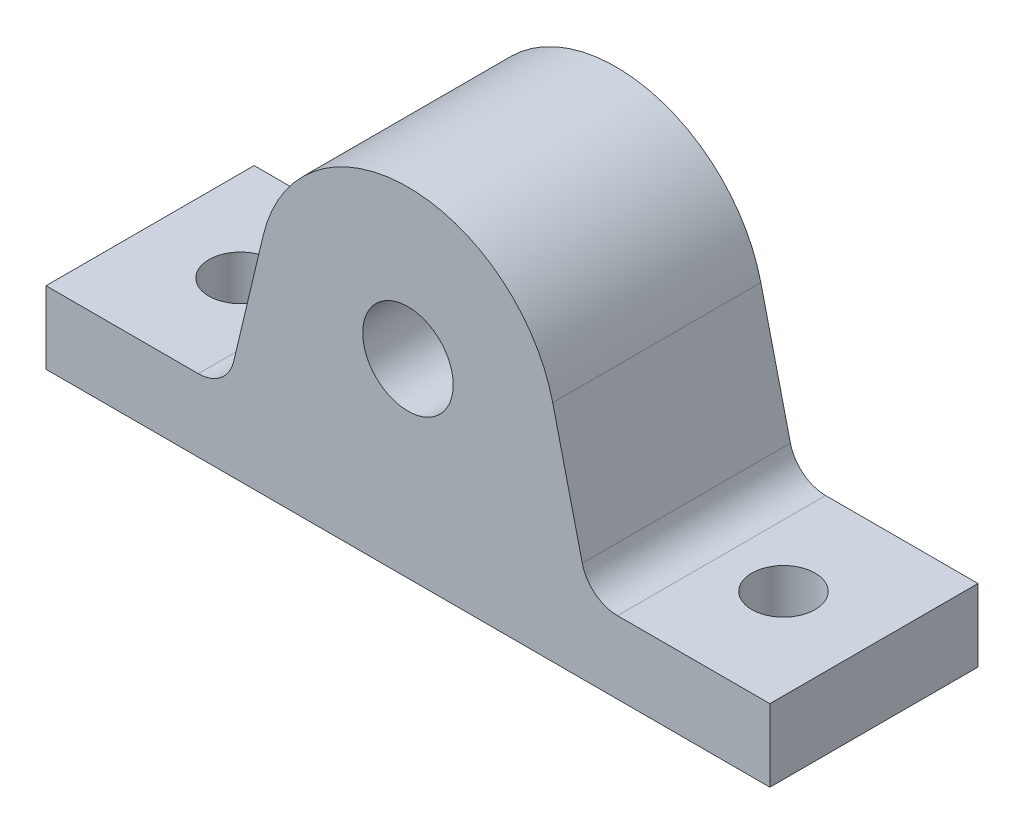
ISO-10303-21;
HEADER;
FILE_DESCRIPTION(('STEP AP214'),'2;1');
FILE_NAME('part.step','',(''),(''),'','','');
FILE_SCHEMA(('AUTOMOTIVE_DESIGN { 1 0 10303 214 1 1 1 1 }'));
ENDSEC;
DATA;
#1=APPLICATION_CONTEXT('core data for automotive mechanical design processes');
#2=APPLICATION_PROTOCOL_DEFINITION('international standard','automotive_design',2000,#1);
#3=PRODUCT_CONTEXT('',#1,'mechanical');
#4=PRODUCT('Part','Part','',(#3));
#5=PRODUCT_RELATED_PRODUCT_CATEGORY('part','',(#4));
#6=PRODUCT_DEFINITION_FORMATION('','',#4);
#7=PRODUCT_DEFINITION_CONTEXT('part definition',#1,'design');
#8=PRODUCT_DEFINITION('design','',#6,#7);
#9=PRODUCT_DEFINITION_SHAPE('','',#8);
#10=(LENGTH_UNIT() NAMED_UNIT(*) SI_UNIT(.MILLI.,.METRE.));
#11=(NAMED_UNIT(*) PLANE_ANGLE_UNIT() SI_UNIT($,.RADIAN.));
#12=(NAMED_UNIT(*) SI_UNIT($,.STERADIAN.) SOLID_ANGLE_UNIT());
#13=UNCERTAINTY_MEASURE_WITH_UNIT(LENGTH_MEASURE(1.E-05),#10,'distance_accuracy_value','');
#14=(GEOMETRIC_REPRESENTATION_CONTEXT(3) GLOBAL_UNCERTAINTY_ASSIGNED_CONTEXT((#13)) GLOBAL_UNIT_ASSIGNED_CONTEXT((#10,
#11,#12)) REPRESENTATION_CONTEXT('',''));
#15=CARTESIAN_POINT('',(0.,0.,0.));
#16=DIRECTION('',(0.,0.,1.));
#17=DIRECTION('',(1.,0.,0.));
#18=AXIS2_PLACEMENT_3D('',#15,#16,#17);
#19=CARTESIAN_POINT('',(-63.5,0.,18.25625));
#20=DIRECTION('',(1.,0.,0.));
#21=DIRECTION('',(0.,0.,-1.));
#22=AXIS2_PLACEMENT_3D('',#19,#20,#21);
#23=PLANE('',#22);
#24=DIRECTION('',(0.,-1.,0.));
#25=VECTOR('',#24,1.);
#26=CARTESIAN_POINT('',(-63.5,0.,-18.25625));
#27=LINE('',#26,#25);
#28=CARTESIAN_POINT('',(-63.5,12.7,-18.25625));
#29=VERTEX_POINT('',#28);
#30=CARTESIAN_POINT('',(-63.5,0.,-18.25625));
#31=VERTEX_POINT('',#30);
#32=EDGE_CURVE('E131',#29,#31,#27,.T.);
#33=ORIENTED_EDGE('',*,*,#32,.T.);
#34=DIRECTION('',(0.,0.,-1.));
#35=VECTOR('',#34,1.);
#36=CARTESIAN_POINT('',(-63.5,0.,18.25625));
#37=LINE('',#36,#35);
#38=CARTESIAN_POINT('',(-63.5,0.,18.25625));
#39=VERTEX_POINT('',#38);
#40=EDGE_CURVE('E112',#39,#31,#37,.T.);
#41=ORIENTED_EDGE('',*,*,#40,.F.);
#42=DIRECTION('',(0.,-1.,0.));
#43=VECTOR('',#42,1.);
#44=CARTESIAN_POINT('',(-63.5,0.,18.25625));
#45=LINE('',#44,#43);
#46=CARTESIAN_POINT('',(-63.5,12.7,18.25625));
#47=VERTEX_POINT('',#46);
#48=EDGE_CURVE('E119',#47,#39,#45,.T.);
#49=ORIENTED_EDGE('',*,*,#48,.F.);
#50=DIRECTION('',(0.,0.,-1.));
#51=VECTOR('',#50,1.);
#52=CARTESIAN_POINT('',(-63.5,12.7,18.25625));
#53=LINE('',#52,#51);
#54=EDGE_CURVE('E159',#47,#29,#53,.T.);
#55=ORIENTED_EDGE('',*,*,#54,.T.);
#56=EDGE_LOOP('',(#33,#41,#49,#55));
#57=FACE_BOUND('',#56,.T.);
#58=ADVANCED_FACE('F31',(#57),#23,.F.);
#59=CARTESIAN_POINT('',(-63.5,0.,18.25625));
#60=DIRECTION('',(0.,1.,0.));
#61=DIRECTION('',(0.,0.,1.));
#62=AXIS2_PLACEMENT_3D('',#59,#60,#61);
#63=PLANE('',#62);
#64=CARTESIAN_POINT('',(-47.625,0.,0.));
#65=DIRECTION('',(0.,1.,0.));
#66=DIRECTION('',(0.,0.,1.));
#67=AXIS2_PLACEMENT_3D('',#64,#65,#66);
#68=CIRCLE('',#67,5.55625);
#69=CARTESIAN_POINT('',(-47.625,0.,5.55625));
#70=VERTEX_POINT('',#69);
#71=EDGE_CURVE('E214',#70,#70,#68,.T.);
#72=ORIENTED_EDGE('',*,*,#71,.T.);
#73=EDGE_LOOP('',(#72));
#74=FACE_BOUND('',#73,.T.);
#75=CARTESIAN_POINT('',(47.625,0.,0.));
#76=DIRECTION('',(0.,1.,0.));
#77=DIRECTION('',(0.,0.,1.));
#78=AXIS2_PLACEMENT_3D('',#75,#76,#77);
#79=CIRCLE('',#78,5.55625);
#80=CARTESIAN_POINT('',(47.625,0.,5.55625));
#81=VERTEX_POINT('',#80);
#82=EDGE_CURVE('E208',#81,#81,#79,.T.);
#83=ORIENTED_EDGE('',*,*,#82,.T.);
#84=EDGE_LOOP('',(#83));
#85=FACE_BOUND('',#84,.T.);
#86=DIRECTION('',(1.,0.,0.));
#87=VECTOR('',#86,1.);
#88=CARTESIAN_POINT('',(-63.5,0.,-18.25625));
#89=LINE('',#88,#87);
#90=CARTESIAN_POINT('',(63.5,0.,-18.25625));
#91=VERTEX_POINT('',#90);
#92=EDGE_CURVE('E192',#31,#91,#89,.T.);
#93=ORIENTED_EDGE('',*,*,#92,.T.);
#94=DIRECTION('',(0.,0.,-1.));
#95=VECTOR('',#94,1.);
#96=CARTESIAN_POINT('',(63.5,0.,18.25625));
#97=LINE('',#96,#95);
#98=CARTESIAN_POINT('',(63.5,0.,18.25625));
#99=VERTEX_POINT('',#98);
#100=EDGE_CURVE('E115',#99,#91,#97,.T.);
#101=ORIENTED_EDGE('',*,*,#100,.F.);
#102=DIRECTION('',(1.,0.,0.));
#103=VECTOR('',#102,1.);
#104=CARTESIAN_POINT('',(-63.5,0.,18.25625));
#105=LINE('',#104,#103);
#106=EDGE_CURVE('E108',#39,#99,#105,.T.);
#107=ORIENTED_EDGE('',*,*,#106,.F.);
#108=ORIENTED_EDGE('',*,*,#40,.T.);
#109=EDGE_LOOP('',(#93,#101,#107,#108));
#110=FACE_BOUND('',#109,.T.);
#111=ADVANCED_FACE('F110',(#74,#85,#110),#63,.F.);
#112=CARTESIAN_POINT('',(63.5,0.,18.25625));
#113=DIRECTION('',(-1.,0.,0.));
#114=DIRECTION('',(0.,0.,1.));
#115=AXIS2_PLACEMENT_3D('',#112,#113,#114);
#116=PLANE('',#115);
#117=DIRECTION('',(0.,1.,0.));
#118=VECTOR('',#117,1.);
#119=CARTESIAN_POINT('',(63.5,0.,-18.25625));
#120=LINE('',#119,#118);
#121=CARTESIAN_POINT('',(63.5,12.7,-18.25625));
#122=VERTEX_POINT('',#121);
#123=EDGE_CURVE('E190',#91,#122,#120,.T.);
#124=ORIENTED_EDGE('',*,*,#123,.T.);
#125=DIRECTION('',(0.,0.,-1.));
#126=VECTOR('',#125,1.);
#127=CARTESIAN_POINT('',(63.5,12.7,18.25625));
#128=LINE('',#127,#126);
#129=CARTESIAN_POINT('',(63.5,12.7,18.25625));
#130=VERTEX_POINT('',#129);
#131=EDGE_CURVE('E137',#130,#122,#128,.T.);
#132=ORIENTED_EDGE('',*,*,#131,.F.);
#133=DIRECTION('',(0.,1.,0.));
#134=VECTOR('',#133,1.);
#135=CARTESIAN_POINT('',(63.5,0.,18.25625));
#136=LINE('',#135,#134);
#137=EDGE_CURVE('E118',#99,#130,#136,.T.);
#138=ORIENTED_EDGE('',*,*,#137,.F.);
#139=ORIENTED_EDGE('',*,*,#100,.T.);
#140=EDGE_LOOP('',(#124,#132,#138,#139));
#141=FACE_BOUND('',#140,.T.);
#142=ADVANCED_FACE('F248',(#141),#116,.F.);
#143=CARTESIAN_POINT('',(63.5,12.7,18.25625));
#144=DIRECTION('',(0.,-1.,0.));
#145=DIRECTION('',(0.,0.,-1.));
#146=AXIS2_PLACEMENT_3D('',#143,#144,#145);
#147=PLANE('',#146);
#148=CARTESIAN_POINT('',(47.625,12.7,0.));
#149=DIRECTION('',(0.,1.,0.));
#150=DIRECTION('',(0.,0.,1.));
#151=AXIS2_PLACEMENT_3D('',#148,#149,#150);
#152=CIRCLE('',#151,5.55625);
#153=CARTESIAN_POINT('',(47.625,12.7,5.55625));
#154=VERTEX_POINT('',#153);
#155=EDGE_CURVE('E211',#154,#154,#152,.T.);
#156=ORIENTED_EDGE('',*,*,#155,.F.);
#157=EDGE_LOOP('',(#156));
#158=FACE_BOUND('',#157,.T.);
#159=DIRECTION('',(-1.,0.,0.));
#160=VECTOR('',#159,1.);
#161=CARTESIAN_POINT('',(63.5,12.7,-18.25625));
#162=LINE('',#161,#160);
#163=CARTESIAN_POINT('',(36.7661395503402,12.7,-18.25625));
#164=VERTEX_POINT('',#163);
#165=EDGE_CURVE('E186',#122,#164,#162,.T.);
#166=ORIENTED_EDGE('',*,*,#165,.T.);
#167=DIRECTION('',(0.,0.,-1.));
#168=VECTOR('',#167,1.);
#169=CARTESIAN_POINT('',(36.7661395503402,12.7,18.25625));
#170=LINE('',#169,#168);
#171=CARTESIAN_POINT('',(36.7661395503402,12.7,18.25625));
#172=VERTEX_POINT('',#171);
#173=EDGE_CURVE('E46',#164,#172,#170,.F.);
#174=ORIENTED_EDGE('',*,*,#173,.T.);
#175=DIRECTION('',(-1.,0.,0.));
#176=VECTOR('',#175,1.);
#177=CARTESIAN_POINT('',(63.5,12.7,18.25625));
#178=LINE('',#177,#176);
#179=EDGE_CURVE('E187',#130,#172,#178,.T.);
#180=ORIENTED_EDGE('',*,*,#179,.F.);
#181=ORIENTED_EDGE('',*,*,#131,.T.);
#182=EDGE_LOOP('',(#166,#174,#180,#181));
#183=FACE_BOUND('',#182,.T.);
#184=ADVANCED_FACE('F185',(#158,#183),#147,.F.);
#185=CARTESIAN_POINT('',(31.75,12.7,18.25625));
#186=DIRECTION('',(-0.972830317924852,-0.231519270312931,0.));
#187=DIRECTION('',(0.231519270312931,-0.972830317924852,0.));
#188=AXIS2_PLACEMENT_3D('',#185,#186,#187);
#189=PLANE('',#188);
#190=DIRECTION('',(-0.231519270312931,0.972830317924852,0.));
#191=VECTOR('',#190,1.);
#192=CARTESIAN_POINT('',(31.75,12.7,18.25625));
#193=LINE('',#192,#191);
#194=CARTESIAN_POINT('',(30.5886670315174,17.5798526335129,18.25625));
#195=VERTEX_POINT('',#194);
#196=CARTESIAN_POINT('',(25.4,39.3823254516701,18.25625));
#197=VERTEX_POINT('',#196);
#198=EDGE_CURVE('E201',#195,#197,#193,.T.);
#199=ORIENTED_EDGE('',*,*,#198,.F.);
#200=DIRECTION('',(0.,0.,-1.));
#201=VECTOR('',#200,1.);
#202=CARTESIAN_POINT('',(30.5886670315174,17.5798526335129,-18.25625));
#203=LINE('',#202,#201);
#204=CARTESIAN_POINT('',(30.5886670315174,17.5798526335129,-18.25625));
#205=VERTEX_POINT('',#204);
#206=EDGE_CURVE('E142',#195,#205,#203,.T.);
#207=ORIENTED_EDGE('',*,*,#206,.T.);
#208=DIRECTION('',(-0.231519270312931,0.972830317924852,0.));
#209=VECTOR('',#208,1.);
#210=CARTESIAN_POINT('',(31.75,12.7,-18.25625));
#211=LINE('',#210,#209);
#212=CARTESIAN_POINT('',(25.4,39.3823254516701,-18.25625));
#213=VERTEX_POINT('',#212);
#214=EDGE_CURVE('E175',#205,#213,#211,.T.);
#215=ORIENTED_EDGE('',*,*,#214,.T.);
#216=DIRECTION('',(0.,0.,-1.));
#217=VECTOR('',#216,1.);
#218=CARTESIAN_POINT('',(25.4,39.3823254516701,18.25625));
#219=LINE('',#218,#217);
#220=EDGE_CURVE('E181',#197,#213,#219,.T.);
#221=ORIENTED_EDGE('',*,*,#220,.F.);
#222=EDGE_LOOP('',(#199,#207,#215,#221));
#223=FACE_BOUND('',#222,.T.);
#224=ADVANCED_FACE('F274',(#223),#189,.F.);
#225=CARTESIAN_POINT('',(0.,33.3375,18.25625));
#226=DIRECTION('',(0.,0.,-1.));
#227=DIRECTION('',(-1.,0.,0.));
#228=AXIS2_PLACEMENT_3D('',#225,#226,#227);
#229=CYLINDRICAL_SURFACE('',#228,26.1093836530309);
#230=CARTESIAN_POINT('',(0.,33.3375,-18.25625));
#231=DIRECTION('',(0.,0.,1.));
#232=DIRECTION('',(-1.,0.,0.));
#233=AXIS2_PLACEMENT_3D('',#230,#231,#232);
#234=CIRCLE('',#233,26.1093836530309);
#235=CARTESIAN_POINT('',(-25.4,39.3823254516701,-18.25625));
#236=VERTEX_POINT('',#235);
#237=EDGE_CURVE('E172',#213,#236,#234,.T.);
#238=ORIENTED_EDGE('',*,*,#237,.T.);
#239=DIRECTION('',(0.,0.,-1.));
#240=VECTOR('',#239,1.);
#241=CARTESIAN_POINT('',(-25.4,39.3823254516701,18.25625));
#242=LINE('',#241,#240);
#243=CARTESIAN_POINT('',(-25.4,39.3823254516701,18.25625));
#244=VERTEX_POINT('',#243);
#245=EDGE_CURVE('E171',#244,#236,#242,.T.);
#246=ORIENTED_EDGE('',*,*,#245,.F.);
#247=CARTESIAN_POINT('',(0.,33.3375,18.25625));
#248=DIRECTION('',(0.,0.,1.));
#249=DIRECTION('',(-1.,0.,0.));
#250=AXIS2_PLACEMENT_3D('',#247,#248,#249);
#251=CIRCLE('',#250,26.1093836530309);
#252=EDGE_CURVE('E199',#197,#244,#251,.T.);
#253=ORIENTED_EDGE('',*,*,#252,.F.);
#254=ORIENTED_EDGE('',*,*,#220,.T.);
#255=EDGE_LOOP('',(#238,#246,#253,#254));
#256=FACE_BOUND('',#255,.T.);
#257=ADVANCED_FACE('F240',(#256),#229,.T.);
#258=CARTESIAN_POINT('',(-31.75,12.7,18.25625));
#259=DIRECTION('',(0.972830317924852,-0.231519270312931,0.));
#260=DIRECTION('',(0.231519270312931,0.972830317924852,0.));
#261=AXIS2_PLACEMENT_3D('',#258,#259,#260);
#262=PLANE('',#261);
#263=DIRECTION('',(-0.231519270312931,-0.972830317924852,0.));
#264=VECTOR('',#263,1.);
#265=CARTESIAN_POINT('',(-31.75,12.7,-18.25625));
#266=LINE('',#265,#264);
#267=CARTESIAN_POINT('',(-30.5886670315174,17.5798526335129,-18.25625));
#268=VERTEX_POINT('',#267);
#269=EDGE_CURVE('E166',#236,#268,#266,.T.);
#270=ORIENTED_EDGE('',*,*,#269,.T.);
#271=DIRECTION('',(0.,0.,-1.));
#272=VECTOR('',#271,1.);
#273=CARTESIAN_POINT('',(-30.5886670315174,17.5798526335129,18.25625));
#274=LINE('',#273,#272);
#275=CARTESIAN_POINT('',(-30.5886670315174,17.5798526335129,18.25625));
#276=VERTEX_POINT('',#275);
#277=EDGE_CURVE('E135',#268,#276,#274,.F.);
#278=ORIENTED_EDGE('',*,*,#277,.T.);
#279=DIRECTION('',(-0.231519270312931,-0.972830317924852,0.));
#280=VECTOR('',#279,1.);
#281=CARTESIAN_POINT('',(-31.75,12.7,18.25625));
#282=LINE('',#281,#280);
#283=EDGE_CURVE('E152',#244,#276,#282,.T.);
#284=ORIENTED_EDGE('',*,*,#283,.F.);
#285=ORIENTED_EDGE('',*,*,#245,.T.);
#286=EDGE_LOOP('',(#270,#278,#284,#285));
#287=FACE_BOUND('',#286,.T.);
#288=ADVANCED_FACE('F169',(#287),#262,.F.);
#289=CARTESIAN_POINT('',(-63.5,12.7,18.25625));
#290=DIRECTION('',(0.,-1.,0.));
#291=DIRECTION('',(0.,0.,-1.));
#292=AXIS2_PLACEMENT_3D('',#289,#290,#291);
#293=PLANE('',#292);
#294=CARTESIAN_POINT('',(-47.625,12.7,0.));
#295=DIRECTION('',(0.,1.,0.));
#296=DIRECTION('',(0.,0.,1.));
#297=AXIS2_PLACEMENT_3D('',#294,#295,#296);
#298=CIRCLE('',#297,5.55625);
#299=CARTESIAN_POINT('',(-47.625,12.7,5.55625));
#300=VERTEX_POINT('',#299);
#301=EDGE_CURVE('E217',#300,#300,#298,.T.);
#302=ORIENTED_EDGE('',*,*,#301,.F.);
#303=EDGE_LOOP('',(#302));
#304=FACE_BOUND('',#303,.T.);
#305=DIRECTION('',(-1.,0.,0.));
#306=VECTOR('',#305,1.);
#307=CARTESIAN_POINT('',(-63.5,12.7,18.25625));
#308=LINE('',#307,#306);
#309=CARTESIAN_POINT('',(-36.7661395503402,12.7,18.25625));
#310=VERTEX_POINT('',#309);
#311=EDGE_CURVE('E124',#310,#47,#308,.T.);
#312=ORIENTED_EDGE('',*,*,#311,.F.);
#313=DIRECTION('',(0.,0.,-1.));
#314=VECTOR('',#313,1.);
#315=CARTESIAN_POINT('',(-36.7661395503402,12.7,-18.25625));
#316=LINE('',#315,#314);
#317=CARTESIAN_POINT('',(-36.7661395503402,12.7,-18.25625));
#318=VERTEX_POINT('',#317);
#319=EDGE_CURVE('E132',#310,#318,#316,.T.);
#320=ORIENTED_EDGE('',*,*,#319,.T.);
#321=DIRECTION('',(-1.,0.,0.));
#322=VECTOR('',#321,1.);
#323=CARTESIAN_POINT('',(-63.5,12.7,-18.25625));
#324=LINE('',#323,#322);
#325=EDGE_CURVE('E128',#318,#29,#324,.T.);
#326=ORIENTED_EDGE('',*,*,#325,.T.);
#327=ORIENTED_EDGE('',*,*,#54,.F.);
#328=EDGE_LOOP('',(#312,#320,#326,#327));
#329=FACE_BOUND('',#328,.T.);
#330=ADVANCED_FACE('F157',(#304,#329),#293,.F.);
#331=CARTESIAN_POINT('',(0.,33.3375,18.25625));
#332=DIRECTION('',(0.,0.,-1.));
#333=DIRECTION('',(-1.,0.,0.));
#334=AXIS2_PLACEMENT_3D('',#331,#332,#333);
#335=PLANE('',#334);
#336=CARTESIAN_POINT('',(0.,33.3375,18.25625));
#337=DIRECTION('',(0.,0.,1.));
#338=DIRECTION('',(1.,0.,0.));
#339=AXIS2_PLACEMENT_3D('',#336,#337,#338);
#340=CIRCLE('',#339,7.9375);
#341=CARTESIAN_POINT('',(7.9375,33.3375,18.25625));
#342=VERTEX_POINT('',#341);
#343=EDGE_CURVE('E205',#342,#342,#340,.T.);
#344=ORIENTED_EDGE('',*,*,#343,.F.);
#345=EDGE_LOOP('',(#344));
#346=FACE_BOUND('',#345,.T.);
#347=ORIENTED_EDGE('',*,*,#48,.T.);
#348=ORIENTED_EDGE('',*,*,#106,.T.);
#349=ORIENTED_EDGE('',*,*,#137,.T.);
#350=ORIENTED_EDGE('',*,*,#179,.T.);
#351=CARTESIAN_POINT('',(36.7661395503402,19.05,18.25625));
#352=DIRECTION('',(0.,0.,-1.));
#353=DIRECTION('',(-1.,0.,0.));
#354=AXIS2_PLACEMENT_3D('',#351,#352,#353);
#355=CIRCLE('',#354,6.35);
#356=EDGE_CURVE('E11',#172,#195,#355,.T.);
#357=ORIENTED_EDGE('',*,*,#356,.T.);
#358=ORIENTED_EDGE('',*,*,#198,.T.);
#359=ORIENTED_EDGE('',*,*,#252,.T.);
#360=ORIENTED_EDGE('',*,*,#283,.T.);
#361=CARTESIAN_POINT('',(-36.7661395503402,19.05,18.25625));
#362=DIRECTION('',(0.,0.,-1.));
#363=DIRECTION('',(-1.,0.,0.));
#364=AXIS2_PLACEMENT_3D('',#361,#362,#363);
#365=CIRCLE('',#364,6.35);
#366=EDGE_CURVE('E148',#276,#310,#365,.T.);
#367=ORIENTED_EDGE('',*,*,#366,.T.);
#368=ORIENTED_EDGE('',*,*,#311,.T.);
#369=EDGE_LOOP('',(#347,#348,#349,#350,#357,#358,#359,#360,#367,#368));
#370=FACE_BOUND('',#369,.T.);
#371=ADVANCED_FACE('F122',(#346,#370),#335,.F.);
#372=CARTESIAN_POINT('',(0.,33.3375,-18.25625));
#373=DIRECTION('',(0.,0.,-1.));
#374=DIRECTION('',(-1.,0.,0.));
#375=AXIS2_PLACEMENT_3D('',#372,#373,#374);
#376=PLANE('',#375);
#377=CARTESIAN_POINT('',(0.,33.3375,-18.25625));
#378=DIRECTION('',(0.,0.,1.));
#379=DIRECTION('',(1.,0.,0.));
#380=AXIS2_PLACEMENT_3D('',#377,#378,#379);
#381=CIRCLE('',#380,7.9375);
#382=CARTESIAN_POINT('',(7.9375,33.3375,-18.25625));
#383=VERTEX_POINT('',#382);
#384=EDGE_CURVE('E196',#383,#383,#381,.T.);
#385=ORIENTED_EDGE('',*,*,#384,.T.);
#386=EDGE_LOOP('',(#385));
#387=FACE_BOUND('',#386,.T.);
#388=ORIENTED_EDGE('',*,*,#32,.F.);
#389=ORIENTED_EDGE('',*,*,#325,.F.);
#390=CARTESIAN_POINT('',(-36.7661395503402,19.05,-18.25625));
#391=DIRECTION('',(0.,0.,-1.));
#392=DIRECTION('',(-1.,0.,0.));
#393=AXIS2_PLACEMENT_3D('',#390,#391,#392);
#394=CIRCLE('',#393,6.35);
#395=EDGE_CURVE('E146',#318,#268,#394,.F.);
#396=ORIENTED_EDGE('',*,*,#395,.T.);
#397=ORIENTED_EDGE('',*,*,#269,.F.);
#398=ORIENTED_EDGE('',*,*,#237,.F.);
#399=ORIENTED_EDGE('',*,*,#214,.F.);
#400=CARTESIAN_POINT('',(36.7661395503402,19.05,-18.25625));
#401=DIRECTION('',(0.,0.,-1.));
#402=DIRECTION('',(-1.,0.,0.));
#403=AXIS2_PLACEMENT_3D('',#400,#401,#402);
#404=CIRCLE('',#403,6.35);
#405=EDGE_CURVE('E39',#205,#164,#404,.F.);
#406=ORIENTED_EDGE('',*,*,#405,.T.);
#407=ORIENTED_EDGE('',*,*,#165,.F.);
#408=ORIENTED_EDGE('',*,*,#123,.F.);
#409=ORIENTED_EDGE('',*,*,#92,.F.);
#410=EDGE_LOOP('',(#388,#389,#396,#397,#398,#399,#406,#407,#408,#409));
#411=FACE_BOUND('',#410,.T.);
#412=ADVANCED_FACE('F164',(#387,#411),#376,.T.);
#413=CARTESIAN_POINT('',(-36.7661395503402,19.05,18.25625));
#414=DIRECTION('',(0.,0.,1.));
#415=DIRECTION('',(1.,0.,0.));
#416=AXIS2_PLACEMENT_3D('',#413,#414,#415);
#417=CYLINDRICAL_SURFACE('',#416,6.35);
#418=ORIENTED_EDGE('',*,*,#366,.F.);
#419=ORIENTED_EDGE('',*,*,#277,.F.);
#420=ORIENTED_EDGE('',*,*,#395,.F.);
#421=ORIENTED_EDGE('',*,*,#319,.F.);
#422=EDGE_LOOP('',(#418,#419,#420,#421));
#423=FACE_BOUND('',#422,.T.);
#424=ADVANCED_FACE('F161',(#423),#417,.F.);
#425=CARTESIAN_POINT('',(36.7661395503402,19.05,18.25625));
#426=DIRECTION('',(0.,0.,1.));
#427=DIRECTION('',(1.,0.,0.));
#428=AXIS2_PLACEMENT_3D('',#425,#426,#427);
#429=CYLINDRICAL_SURFACE('',#428,6.35);
#430=ORIENTED_EDGE('',*,*,#356,.F.);
#431=ORIENTED_EDGE('',*,*,#173,.F.);
#432=ORIENTED_EDGE('',*,*,#405,.F.);
#433=ORIENTED_EDGE('',*,*,#206,.F.);
#434=EDGE_LOOP('',(#430,#431,#432,#433));
#435=FACE_BOUND('',#434,.T.);
#436=ADVANCED_FACE('F33',(#435),#429,.F.);
#437=CARTESIAN_POINT('',(0.,33.3375,-18.25625));
#438=DIRECTION('',(0.,0.,1.));
#439=DIRECTION('',(1.,0.,0.));
#440=AXIS2_PLACEMENT_3D('',#437,#438,#439);
#441=CYLINDRICAL_SURFACE('',#440,7.9375);
#442=ORIENTED_EDGE('',*,*,#384,.F.);
#443=EDGE_LOOP('',(#442));
#444=FACE_BOUND('',#443,.T.);
#445=ORIENTED_EDGE('',*,*,#343,.T.);
#446=EDGE_LOOP('',(#445));
#447=FACE_BOUND('',#446,.T.);
#448=ADVANCED_FACE('F256',(#444,#447),#441,.F.);
#449=CARTESIAN_POINT('',(47.625,0.,0.));
#450=DIRECTION('',(0.,1.,0.));
#451=DIRECTION('',(0.,0.,1.));
#452=AXIS2_PLACEMENT_3D('',#449,#450,#451);
#453=CYLINDRICAL_SURFACE('',#452,5.55625);
#454=ORIENTED_EDGE('',*,*,#82,.F.);
#455=EDGE_LOOP('',(#454));
#456=FACE_BOUND('',#455,.T.);
#457=ORIENTED_EDGE('',*,*,#155,.T.);
#458=EDGE_LOOP('',(#457));
#459=FACE_BOUND('',#458,.T.);
#460=ADVANCED_FACE('F228',(#456,#459),#453,.F.);
#461=CARTESIAN_POINT('',(-47.625,0.,0.));
#462=DIRECTION('',(0.,1.,0.));
#463=DIRECTION('',(0.,0.,1.));
#464=AXIS2_PLACEMENT_3D('',#461,#462,#463);
#465=CYLINDRICAL_SURFACE('',#464,5.55625);
#466=ORIENTED_EDGE('',*,*,#71,.F.);
#467=EDGE_LOOP('',(#466));
#468=FACE_BOUND('',#467,.T.);
#469=ORIENTED_EDGE('',*,*,#301,.T.);
#470=EDGE_LOOP('',(#469));
#471=FACE_BOUND('',#470,.T.);
#472=ADVANCED_FACE('F225',(#468,#471),#465,.F.);
#473=CLOSED_SHELL('',(#58,#111,#142,#184,#224,#257,#288,#330,#371,#412,#424,#436,#448,#460,#472));
#474=MANIFOLD_SOLID_BREP('B2',#473);
#475=ADVANCED_BREP_SHAPE_REPRESENTATION('',(#18,#474),#14);
#476=SHAPE_DEFINITION_REPRESENTATION(#9,#475);
ENDSEC;
END-ISO-10303-21;
